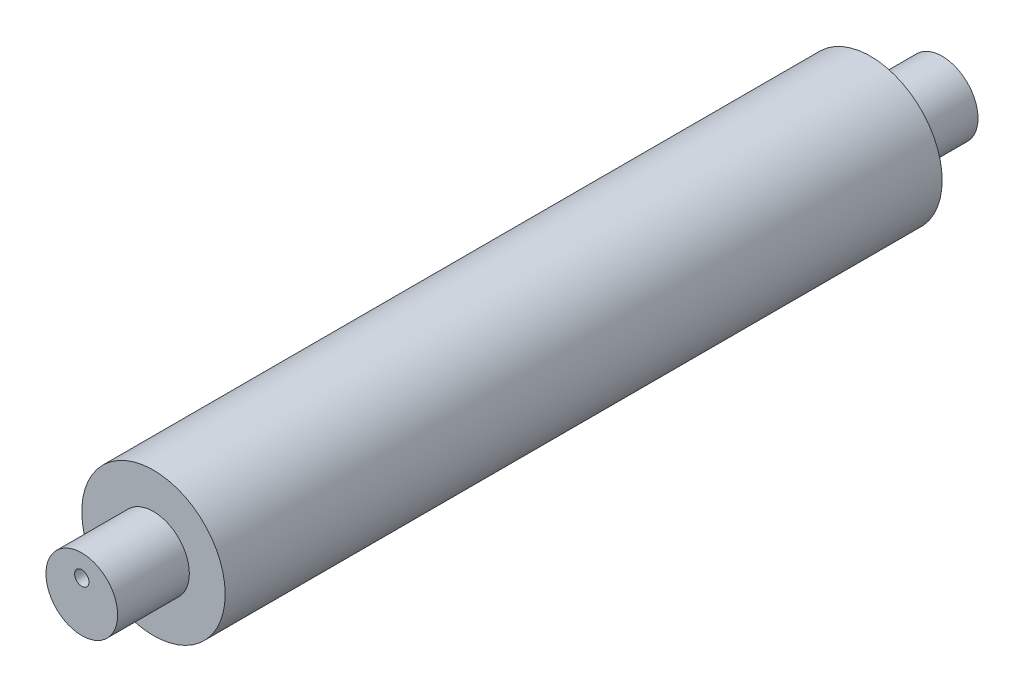
ISO-10303-21;
HEADER;
FILE_DESCRIPTION(('STEP AP214'),'2;1');
FILE_NAME('part.step','',(''),(''),'','','');
FILE_SCHEMA(('AUTOMOTIVE_DESIGN { 1 0 10303 214 1 1 1 1 }'));
ENDSEC;
DATA;
#1=APPLICATION_CONTEXT('core data for automotive mechanical design processes');
#2=APPLICATION_PROTOCOL_DEFINITION('international standard','automotive_design',2000,#1);
#3=PRODUCT_CONTEXT('',#1,'mechanical');
#4=PRODUCT('Part','Part','',(#3));
#5=PRODUCT_RELATED_PRODUCT_CATEGORY('part','',(#4));
#6=PRODUCT_DEFINITION_FORMATION('','',#4);
#7=PRODUCT_DEFINITION_CONTEXT('part definition',#1,'design');
#8=PRODUCT_DEFINITION('design','',#6,#7);
#9=PRODUCT_DEFINITION_SHAPE('','',#8);
#10=(LENGTH_UNIT() NAMED_UNIT(*) SI_UNIT(.MILLI.,.METRE.));
#11=(NAMED_UNIT(*) PLANE_ANGLE_UNIT() SI_UNIT($,.RADIAN.));
#12=(NAMED_UNIT(*) SI_UNIT($,.STERADIAN.) SOLID_ANGLE_UNIT());
#13=UNCERTAINTY_MEASURE_WITH_UNIT(LENGTH_MEASURE(1.E-05),#10,'distance_accuracy_value','');
#14=(GEOMETRIC_REPRESENTATION_CONTEXT(3) GLOBAL_UNCERTAINTY_ASSIGNED_CONTEXT((#13)) GLOBAL_UNIT_ASSIGNED_CONTEXT((#10,
#11,#12)) REPRESENTATION_CONTEXT('',''));
#15=CARTESIAN_POINT('',(0.,0.,0.));
#16=DIRECTION('',(0.,0.,1.));
#17=DIRECTION('',(1.,0.,0.));
#18=AXIS2_PLACEMENT_3D('',#15,#16,#17);
#19=CARTESIAN_POINT('',(0.,0.,125.));
#20=DIRECTION('',(0.,0.,-1.));
#21=DIRECTION('',(-1.,0.,0.));
#22=AXIS2_PLACEMENT_3D('',#19,#20,#21);
#23=CYLINDRICAL_SURFACE('',#22,25.);
#24=CARTESIAN_POINT('',(0.,0.,125.));
#25=DIRECTION('',(0.,0.,1.));
#26=DIRECTION('',(1.,0.,0.));
#27=AXIS2_PLACEMENT_3D('',#24,#25,#26);
#28=CIRCLE('',#27,25.);
#29=CARTESIAN_POINT('',(25.,0.,125.));
#30=VERTEX_POINT('',#29);
#31=EDGE_CURVE('E42',#30,#30,#28,.T.);
#32=ORIENTED_EDGE('',*,*,#31,.F.);
#33=EDGE_LOOP('',(#32));
#34=FACE_BOUND('',#33,.T.);
#35=CARTESIAN_POINT('',(0.,0.,-125.));
#36=DIRECTION('',(0.,0.,1.));
#37=DIRECTION('',(1.,0.,0.));
#38=AXIS2_PLACEMENT_3D('',#35,#36,#37);
#39=CIRCLE('',#38,25.);
#40=CARTESIAN_POINT('',(25.,0.,-125.));
#41=VERTEX_POINT('',#40);
#42=EDGE_CURVE('E46',#41,#41,#39,.T.);
#43=ORIENTED_EDGE('',*,*,#42,.T.);
#44=EDGE_LOOP('',(#43));
#45=FACE_BOUND('',#44,.T.);
#46=ADVANCED_FACE('F36',(#34,#45),#23,.T.);
#47=CARTESIAN_POINT('',(0.,0.,125.));
#48=DIRECTION('',(0.,0.,1.));
#49=DIRECTION('',(1.,0.,0.));
#50=AXIS2_PLACEMENT_3D('',#47,#48,#49);
#51=PLANE('',#50);
#52=CARTESIAN_POINT('',(0.,0.,125.));
#53=DIRECTION('',(0.,0.,1.));
#54=DIRECTION('',(1.,0.,0.));
#55=AXIS2_PLACEMENT_3D('',#52,#53,#54);
#56=CIRCLE('',#55,12.5);
#57=CARTESIAN_POINT('',(12.5,0.,125.));
#58=VERTEX_POINT('',#57);
#59=EDGE_CURVE('E51',#58,#58,#56,.F.);
#60=ORIENTED_EDGE('',*,*,#59,.T.);
#61=EDGE_LOOP('',(#60));
#62=FACE_BOUND('',#61,.T.);
#63=ORIENTED_EDGE('',*,*,#31,.T.);
#64=EDGE_LOOP('',(#63));
#65=FACE_BOUND('',#64,.T.);
#66=ADVANCED_FACE('F104',(#62,#65),#51,.T.);
#67=CARTESIAN_POINT('',(0.,0.,-125.));
#68=DIRECTION('',(0.,0.,1.));
#69=DIRECTION('',(1.,0.,0.));
#70=AXIS2_PLACEMENT_3D('',#67,#68,#69);
#71=PLANE('',#70);
#72=CARTESIAN_POINT('',(0.,0.,-125.));
#73=DIRECTION('',(0.,0.,1.));
#74=DIRECTION('',(1.,0.,0.));
#75=AXIS2_PLACEMENT_3D('',#72,#73,#74);
#76=CIRCLE('',#75,12.5);
#77=CARTESIAN_POINT('',(12.5,0.,-125.));
#78=VERTEX_POINT('',#77);
#79=EDGE_CURVE('E10',#78,#78,#76,.F.);
#80=ORIENTED_EDGE('',*,*,#79,.F.);
#81=EDGE_LOOP('',(#80));
#82=FACE_BOUND('',#81,.T.);
#83=ORIENTED_EDGE('',*,*,#42,.F.);
#84=EDGE_LOOP('',(#83));
#85=FACE_BOUND('',#84,.T.);
#86=ADVANCED_FACE('F109',(#82,#85),#71,.F.);
#87=CARTESIAN_POINT('',(0.,0.,-150.));
#88=DIRECTION('',(0.,0.,1.));
#89=DIRECTION('',(1.,0.,0.));
#90=AXIS2_PLACEMENT_3D('',#87,#88,#89);
#91=PLANE('',#90);
#92=CARTESIAN_POINT('',(0.,4.91077602968974,-150.));
#93=DIRECTION('',(0.,0.,-1.));
#94=DIRECTION('',(-1.,0.,0.));
#95=AXIS2_PLACEMENT_3D('',#92,#93,#94);
#96=CIRCLE('',#95,2.5);
#97=CARTESIAN_POINT('',(-2.5,4.91077602968974,-150.));
#98=VERTEX_POINT('',#97);
#99=EDGE_CURVE('E62',#98,#98,#96,.T.);
#100=ORIENTED_EDGE('',*,*,#99,.F.);
#101=EDGE_LOOP('',(#100));
#102=FACE_BOUND('',#101,.T.);
#103=CARTESIAN_POINT('',(0.,0.,-150.));
#104=DIRECTION('',(0.,0.,1.));
#105=DIRECTION('',(1.,0.,0.));
#106=AXIS2_PLACEMENT_3D('',#103,#104,#105);
#107=CIRCLE('',#106,12.5);
#108=CARTESIAN_POINT('',(12.5,0.,-150.));
#109=VERTEX_POINT('',#108);
#110=EDGE_CURVE('E56',#109,#109,#107,.T.);
#111=ORIENTED_EDGE('',*,*,#110,.F.);
#112=EDGE_LOOP('',(#111));
#113=FACE_BOUND('',#112,.T.);
#114=ADVANCED_FACE('F98',(#102,#113),#91,.F.);
#115=CARTESIAN_POINT('',(0.,0.,150.));
#116=DIRECTION('',(0.,0.,-1.));
#117=DIRECTION('',(-1.,0.,0.));
#118=AXIS2_PLACEMENT_3D('',#115,#116,#117);
#119=CYLINDRICAL_SURFACE('',#118,12.5);
#120=ORIENTED_EDGE('',*,*,#110,.T.);
#121=EDGE_LOOP('',(#120));
#122=FACE_BOUND('',#121,.T.);
#123=ORIENTED_EDGE('',*,*,#79,.T.);
#124=EDGE_LOOP('',(#123));
#125=FACE_BOUND('',#124,.T.);
#126=ADVANCED_FACE('F92',(#122,#125),#119,.T.);
#127=ORIENTED_EDGE('',*,*,#59,.F.);
#128=EDGE_LOOP('',(#127));
#129=FACE_BOUND('',#128,.T.);
#130=CARTESIAN_POINT('',(0.,0.,150.));
#131=DIRECTION('',(0.,0.,1.));
#132=DIRECTION('',(1.,0.,0.));
#133=AXIS2_PLACEMENT_3D('',#130,#131,#132);
#134=CIRCLE('',#133,12.5);
#135=CARTESIAN_POINT('',(12.5,0.,150.));
#136=VERTEX_POINT('',#135);
#137=EDGE_CURVE('E55',#136,#136,#134,.T.);
#138=ORIENTED_EDGE('',*,*,#137,.F.);
#139=EDGE_LOOP('',(#138));
#140=FACE_BOUND('',#139,.T.);
#141=ADVANCED_FACE('F87',(#129,#140),#119,.T.);
#142=CARTESIAN_POINT('',(0.,0.,150.));
#143=DIRECTION('',(0.,0.,1.));
#144=DIRECTION('',(1.,0.,0.));
#145=AXIS2_PLACEMENT_3D('',#142,#143,#144);
#146=PLANE('',#145);
#147=CARTESIAN_POINT('',(0.,4.91077602968974,150.));
#148=DIRECTION('',(0.,0.,1.));
#149=DIRECTION('',(1.,0.,0.));
#150=AXIS2_PLACEMENT_3D('',#147,#148,#149);
#151=CIRCLE('',#150,2.5);
#152=CARTESIAN_POINT('',(2.5,4.91077602968974,150.));
#153=VERTEX_POINT('',#152);
#154=EDGE_CURVE('E68',#153,#153,#151,.T.);
#155=ORIENTED_EDGE('',*,*,#154,.F.);
#156=EDGE_LOOP('',(#155));
#157=FACE_BOUND('',#156,.T.);
#158=ORIENTED_EDGE('',*,*,#137,.T.);
#159=EDGE_LOOP('',(#158));
#160=FACE_BOUND('',#159,.T.);
#161=ADVANCED_FACE('F83',(#157,#160),#146,.T.);
#162=CARTESIAN_POINT('',(0.,4.91077602968974,-130.));
#163=DIRECTION('',(0.,0.,-1.));
#164=DIRECTION('',(-1.,0.,0.));
#165=AXIS2_PLACEMENT_3D('',#162,#163,#164);
#166=CYLINDRICAL_SURFACE('',#165,2.5);
#167=CARTESIAN_POINT('',(0.,4.91077602968974,-130.));
#168=DIRECTION('',(0.,0.,-1.));
#169=DIRECTION('',(-1.,0.,0.));
#170=AXIS2_PLACEMENT_3D('',#167,#168,#169);
#171=CIRCLE('',#170,2.5);
#172=CARTESIAN_POINT('',(-2.5,4.91077602968974,-130.));
#173=VERTEX_POINT('',#172);
#174=EDGE_CURVE('E59',#173,#173,#171,.T.);
#175=ORIENTED_EDGE('',*,*,#174,.F.);
#176=EDGE_LOOP('',(#175));
#177=FACE_BOUND('',#176,.T.);
#178=ORIENTED_EDGE('',*,*,#99,.T.);
#179=EDGE_LOOP('',(#178));
#180=FACE_BOUND('',#179,.T.);
#181=ADVANCED_FACE('F86',(#177,#180),#166,.F.);
#182=CARTESIAN_POINT('',(0.,4.91077602968974,-130.));
#183=DIRECTION('',(0.,0.,-1.));
#184=DIRECTION('',(-1.,0.,0.));
#185=AXIS2_PLACEMENT_3D('',#182,#183,#184);
#186=PLANE('',#185);
#187=ORIENTED_EDGE('',*,*,#174,.T.);
#188=EDGE_LOOP('',(#187));
#189=FACE_BOUND('',#188,.T.);
#190=ADVANCED_FACE('F79',(#189),#186,.T.);
#191=CARTESIAN_POINT('',(0.,4.91077602968974,130.));
#192=DIRECTION('',(0.,0.,1.));
#193=DIRECTION('',(1.,0.,0.));
#194=AXIS2_PLACEMENT_3D('',#191,#192,#193);
#195=CYLINDRICAL_SURFACE('',#194,2.5);
#196=CARTESIAN_POINT('',(0.,4.91077602968974,130.));
#197=DIRECTION('',(0.,0.,1.));
#198=DIRECTION('',(1.,0.,0.));
#199=AXIS2_PLACEMENT_3D('',#196,#197,#198);
#200=CIRCLE('',#199,2.5);
#201=CARTESIAN_POINT('',(2.5,4.91077602968974,130.));
#202=VERTEX_POINT('',#201);
#203=EDGE_CURVE('E65',#202,#202,#200,.T.);
#204=ORIENTED_EDGE('',*,*,#203,.F.);
#205=EDGE_LOOP('',(#204));
#206=FACE_BOUND('',#205,.T.);
#207=ORIENTED_EDGE('',*,*,#154,.T.);
#208=EDGE_LOOP('',(#207));
#209=FACE_BOUND('',#208,.T.);
#210=ADVANCED_FACE('F76',(#206,#209),#195,.F.);
#211=CARTESIAN_POINT('',(0.,4.91077602968974,130.));
#212=DIRECTION('',(0.,0.,1.));
#213=DIRECTION('',(1.,0.,0.));
#214=AXIS2_PLACEMENT_3D('',#211,#212,#213);
#215=PLANE('',#214);
#216=ORIENTED_EDGE('',*,*,#203,.T.);
#217=EDGE_LOOP('',(#216));
#218=FACE_BOUND('',#217,.T.);
#219=ADVANCED_FACE('F74',(#218),#215,.T.);
#220=CLOSED_SHELL('',(#46,#66,#86,#114,#126,#141,#161,#181,#190,#210,#219));
#221=MANIFOLD_SOLID_BREP('B2',#220);
#222=ADVANCED_BREP_SHAPE_REPRESENTATION('',(#18,#221),#14);
#223=SHAPE_DEFINITION_REPRESENTATION(#9,#222);
ENDSEC;
END-ISO-10303-21;
